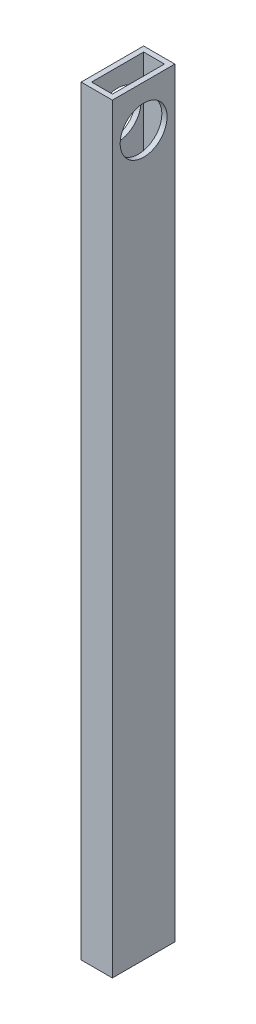
ISO-10303-21;
HEADER;
FILE_DESCRIPTION(('STEP AP214'),'2;1');
FILE_NAME('part.step','',(''),(''),'','','');
FILE_SCHEMA(('AUTOMOTIVE_DESIGN { 1 0 10303 214 1 1 1 1 }'));
ENDSEC;
DATA;
#1=APPLICATION_CONTEXT('core data for automotive mechanical design processes');
#2=APPLICATION_PROTOCOL_DEFINITION('international standard','automotive_design',2000,#1);
#3=PRODUCT_CONTEXT('',#1,'mechanical');
#4=PRODUCT('Part','Part','',(#3));
#5=PRODUCT_RELATED_PRODUCT_CATEGORY('part','',(#4));
#6=PRODUCT_DEFINITION_FORMATION('','',#4);
#7=PRODUCT_DEFINITION_CONTEXT('part definition',#1,'design');
#8=PRODUCT_DEFINITION('design','',#6,#7);
#9=PRODUCT_DEFINITION_SHAPE('','',#8);
#10=(LENGTH_UNIT() NAMED_UNIT(*) SI_UNIT(.MILLI.,.METRE.));
#11=(NAMED_UNIT(*) PLANE_ANGLE_UNIT() SI_UNIT($,.RADIAN.));
#12=(NAMED_UNIT(*) SI_UNIT($,.STERADIAN.) SOLID_ANGLE_UNIT());
#13=UNCERTAINTY_MEASURE_WITH_UNIT(LENGTH_MEASURE(1.E-05),#10,'distance_accuracy_value','');
#14=(GEOMETRIC_REPRESENTATION_CONTEXT(3) GLOBAL_UNCERTAINTY_ASSIGNED_CONTEXT((#13)) GLOBAL_UNIT_ASSIGNED_CONTEXT((#10,
#11,#12)) REPRESENTATION_CONTEXT('',''));
#15=CARTESIAN_POINT('',(0.,0.,0.));
#16=DIRECTION('',(0.,0.,1.));
#17=DIRECTION('',(1.,0.,0.));
#18=AXIS2_PLACEMENT_3D('',#15,#16,#17);
#19=CARTESIAN_POINT('',(0.,463.55,0.));
#20=DIRECTION('',(0.,1.,0.));
#21=DIRECTION('',(0.,0.,1.));
#22=AXIS2_PLACEMENT_3D('',#19,#20,#21);
#23=PLANE('',#22);
#24=DIRECTION('',(0.,0.,1.));
#25=VECTOR('',#24,1.);
#26=CARTESIAN_POINT('',(0.,463.55,0.));
#27=LINE('',#26,#25);
#28=CARTESIAN_POINT('',(0.,463.55,-38.1));
#29=VERTEX_POINT('',#28);
#30=CARTESIAN_POINT('',(0.,463.55,0.));
#31=VERTEX_POINT('',#30);
#32=EDGE_CURVE('E161',#29,#31,#27,.T.);
#33=ORIENTED_EDGE('',*,*,#32,.T.);
#34=DIRECTION('',(1.,0.,0.));
#35=VECTOR('',#34,1.);
#36=CARTESIAN_POINT('',(0.,463.55,0.));
#37=LINE('',#36,#35);
#38=CARTESIAN_POINT('',(19.05,463.55,0.));
#39=VERTEX_POINT('',#38);
#40=EDGE_CURVE('E164',#31,#39,#37,.T.);
#41=ORIENTED_EDGE('',*,*,#40,.T.);
#42=DIRECTION('',(0.,0.,-1.));
#43=VECTOR('',#42,1.);
#44=CARTESIAN_POINT('',(19.05,463.55,0.));
#45=LINE('',#44,#43);
#46=CARTESIAN_POINT('',(19.05,463.55,-38.1));
#47=VERTEX_POINT('',#46);
#48=EDGE_CURVE('E167',#39,#47,#45,.T.);
#49=ORIENTED_EDGE('',*,*,#48,.T.);
#50=DIRECTION('',(-1.,0.,0.));
#51=VECTOR('',#50,1.);
#52=CARTESIAN_POINT('',(0.,463.55,-38.1));
#53=LINE('',#52,#51);
#54=EDGE_CURVE('E169',#47,#29,#53,.T.);
#55=ORIENTED_EDGE('',*,*,#54,.T.);
#56=EDGE_LOOP('',(#33,#41,#49,#55));
#57=FACE_BOUND('',#56,.T.);
#58=DIRECTION('',(1.,0.,0.));
#59=VECTOR('',#58,1.);
#60=CARTESIAN_POINT('',(0.,463.55,-3.175));
#61=LINE('',#60,#59);
#62=CARTESIAN_POINT('',(3.175,463.55,-3.175));
#63=VERTEX_POINT('',#62);
#64=CARTESIAN_POINT('',(15.875,463.55,-3.175));
#65=VERTEX_POINT('',#64);
#66=EDGE_CURVE('E131',#63,#65,#61,.T.);
#67=ORIENTED_EDGE('',*,*,#66,.F.);
#68=DIRECTION('',(0.,0.,1.));
#69=VECTOR('',#68,1.);
#70=CARTESIAN_POINT('',(3.175,463.55,0.));
#71=LINE('',#70,#69);
#72=CARTESIAN_POINT('',(3.175,463.55,-34.925));
#73=VERTEX_POINT('',#72);
#74=EDGE_CURVE('E123',#73,#63,#71,.T.);
#75=ORIENTED_EDGE('',*,*,#74,.F.);
#76=DIRECTION('',(-1.,0.,0.));
#77=VECTOR('',#76,1.);
#78=CARTESIAN_POINT('',(0.,463.55,-34.925));
#79=LINE('',#78,#77);
#80=CARTESIAN_POINT('',(15.875,463.55,-34.925));
#81=VERTEX_POINT('',#80);
#82=EDGE_CURVE('E145',#81,#73,#79,.T.);
#83=ORIENTED_EDGE('',*,*,#82,.F.);
#84=DIRECTION('',(0.,0.,-1.));
#85=VECTOR('',#84,1.);
#86=CARTESIAN_POINT('',(15.875,463.55,0.));
#87=LINE('',#86,#85);
#88=EDGE_CURVE('E143',#65,#81,#87,.T.);
#89=ORIENTED_EDGE('',*,*,#88,.F.);
#90=EDGE_LOOP('',(#67,#75,#83,#89));
#91=FACE_BOUND('',#90,.T.);
#92=ADVANCED_FACE('F57',(#57,#91),#23,.T.);
#93=CARTESIAN_POINT('',(0.,0.,0.));
#94=DIRECTION('',(0.,1.,0.));
#95=DIRECTION('',(0.,0.,1.));
#96=AXIS2_PLACEMENT_3D('',#93,#94,#95);
#97=PLANE('',#96);
#98=DIRECTION('',(0.,0.,1.));
#99=VECTOR('',#98,1.);
#100=CARTESIAN_POINT('',(0.,0.,0.));
#101=LINE('',#100,#99);
#102=CARTESIAN_POINT('',(0.,0.,-38.1));
#103=VERTEX_POINT('',#102);
#104=CARTESIAN_POINT('',(0.,0.,0.));
#105=VERTEX_POINT('',#104);
#106=EDGE_CURVE('E139',#103,#105,#101,.T.);
#107=ORIENTED_EDGE('',*,*,#106,.F.);
#108=DIRECTION('',(-1.,0.,0.));
#109=VECTOR('',#108,1.);
#110=CARTESIAN_POINT('',(0.,0.,-38.1));
#111=LINE('',#110,#109);
#112=CARTESIAN_POINT('',(19.05,0.,-38.1));
#113=VERTEX_POINT('',#112);
#114=EDGE_CURVE('E165',#113,#103,#111,.T.);
#115=ORIENTED_EDGE('',*,*,#114,.F.);
#116=DIRECTION('',(0.,0.,-1.));
#117=VECTOR('',#116,1.);
#118=CARTESIAN_POINT('',(19.05,0.,0.));
#119=LINE('',#118,#117);
#120=CARTESIAN_POINT('',(19.05,0.,0.));
#121=VERTEX_POINT('',#120);
#122=EDGE_CURVE('E176',#121,#113,#119,.T.);
#123=ORIENTED_EDGE('',*,*,#122,.F.);
#124=DIRECTION('',(1.,0.,0.));
#125=VECTOR('',#124,1.);
#126=CARTESIAN_POINT('',(0.,0.,0.));
#127=LINE('',#126,#125);
#128=EDGE_CURVE('E174',#105,#121,#127,.T.);
#129=ORIENTED_EDGE('',*,*,#128,.F.);
#130=EDGE_LOOP('',(#107,#115,#123,#129));
#131=FACE_BOUND('',#130,.T.);
#132=DIRECTION('',(0.,0.,1.));
#133=VECTOR('',#132,1.);
#134=CARTESIAN_POINT('',(3.175,0.,0.));
#135=LINE('',#134,#133);
#136=CARTESIAN_POINT('',(3.175,0.,-34.925));
#137=VERTEX_POINT('',#136);
#138=CARTESIAN_POINT('',(3.175,0.,-3.175));
#139=VERTEX_POINT('',#138);
#140=EDGE_CURVE('E81',#137,#139,#135,.T.);
#141=ORIENTED_EDGE('',*,*,#140,.T.);
#142=DIRECTION('',(1.,0.,0.));
#143=VECTOR('',#142,1.);
#144=CARTESIAN_POINT('',(0.,0.,-3.175));
#145=LINE('',#144,#143);
#146=CARTESIAN_POINT('',(15.875,0.,-3.175));
#147=VERTEX_POINT('',#146);
#148=EDGE_CURVE('E138',#139,#147,#145,.T.);
#149=ORIENTED_EDGE('',*,*,#148,.T.);
#150=DIRECTION('',(0.,0.,-1.));
#151=VECTOR('',#150,1.);
#152=CARTESIAN_POINT('',(15.875,0.,0.));
#153=LINE('',#152,#151);
#154=CARTESIAN_POINT('',(15.875,0.,-34.925));
#155=VERTEX_POINT('',#154);
#156=EDGE_CURVE('E153',#147,#155,#153,.T.);
#157=ORIENTED_EDGE('',*,*,#156,.T.);
#158=DIRECTION('',(-1.,0.,0.));
#159=VECTOR('',#158,1.);
#160=CARTESIAN_POINT('',(0.,0.,-34.925));
#161=LINE('',#160,#159);
#162=EDGE_CURVE('E132',#155,#137,#161,.T.);
#163=ORIENTED_EDGE('',*,*,#162,.T.);
#164=EDGE_LOOP('',(#141,#149,#157,#163));
#165=FACE_BOUND('',#164,.T.);
#166=ADVANCED_FACE('F195',(#131,#165),#97,.F.);
#167=CARTESIAN_POINT('',(0.,463.55,0.));
#168=DIRECTION('',(1.,0.,0.));
#169=DIRECTION('',(0.,0.,-1.));
#170=AXIS2_PLACEMENT_3D('',#167,#168,#169);
#171=PLANE('',#170);
#172=CARTESIAN_POINT('',(0.,438.15,-19.05));
#173=DIRECTION('',(1.,0.,0.));
#174=DIRECTION('',(0.,0.,-1.));
#175=AXIS2_PLACEMENT_3D('',#172,#173,#174);
#176=CIRCLE('',#175,14.2875);
#177=CARTESIAN_POINT('',(0.,438.15,-33.3375));
#178=VERTEX_POINT('',#177);
#179=EDGE_CURVE('E236',#178,#178,#176,.T.);
#180=ORIENTED_EDGE('',*,*,#179,.T.);
#181=EDGE_LOOP('',(#180));
#182=FACE_BOUND('',#181,.T.);
#183=ORIENTED_EDGE('',*,*,#106,.T.);
#184=DIRECTION('',(0.,-1.,0.));
#185=VECTOR('',#184,1.);
#186=CARTESIAN_POINT('',(0.,463.55,0.));
#187=LINE('',#186,#185);
#188=EDGE_CURVE('E12',#31,#105,#187,.T.);
#189=ORIENTED_EDGE('',*,*,#188,.F.);
#190=ORIENTED_EDGE('',*,*,#32,.F.);
#191=DIRECTION('',(0.,-1.,0.));
#192=VECTOR('',#191,1.);
#193=CARTESIAN_POINT('',(0.,463.55,-38.1));
#194=LINE('',#193,#192);
#195=EDGE_CURVE('E171',#29,#103,#194,.T.);
#196=ORIENTED_EDGE('',*,*,#195,.T.);
#197=EDGE_LOOP('',(#183,#189,#190,#196));
#198=FACE_BOUND('',#197,.T.);
#199=ADVANCED_FACE('F59',(#182,#198),#171,.F.);
#200=CARTESIAN_POINT('',(0.,463.55,0.));
#201=DIRECTION('',(0.,0.,-1.));
#202=DIRECTION('',(-1.,0.,0.));
#203=AXIS2_PLACEMENT_3D('',#200,#201,#202);
#204=PLANE('',#203);
#205=ORIENTED_EDGE('',*,*,#128,.T.);
#206=DIRECTION('',(0.,-1.,0.));
#207=VECTOR('',#206,1.);
#208=CARTESIAN_POINT('',(19.05,463.55,0.));
#209=LINE('',#208,#207);
#210=EDGE_CURVE('E66',#39,#121,#209,.T.);
#211=ORIENTED_EDGE('',*,*,#210,.F.);
#212=ORIENTED_EDGE('',*,*,#40,.F.);
#213=ORIENTED_EDGE('',*,*,#188,.T.);
#214=EDGE_LOOP('',(#205,#211,#212,#213));
#215=FACE_BOUND('',#214,.T.);
#216=ADVANCED_FACE('F205',(#215),#204,.F.);
#217=CARTESIAN_POINT('',(19.05,463.55,0.));
#218=DIRECTION('',(-1.,0.,0.));
#219=DIRECTION('',(0.,0.,1.));
#220=AXIS2_PLACEMENT_3D('',#217,#218,#219);
#221=PLANE('',#220);
#222=CARTESIAN_POINT('',(19.05,438.15,-19.05));
#223=DIRECTION('',(1.,0.,0.));
#224=DIRECTION('',(0.,0.,-1.));
#225=AXIS2_PLACEMENT_3D('',#222,#223,#224);
#226=CIRCLE('',#225,14.2875);
#227=CARTESIAN_POINT('',(19.05,438.15,-33.3375));
#228=VERTEX_POINT('',#227);
#229=EDGE_CURVE('E238',#228,#228,#226,.T.);
#230=ORIENTED_EDGE('',*,*,#229,.F.);
#231=EDGE_LOOP('',(#230));
#232=FACE_BOUND('',#231,.T.);
#233=ORIENTED_EDGE('',*,*,#122,.T.);
#234=DIRECTION('',(0.,-1.,0.));
#235=VECTOR('',#234,1.);
#236=CARTESIAN_POINT('',(19.05,463.55,-38.1));
#237=LINE('',#236,#235);
#238=EDGE_CURVE('E181',#47,#113,#237,.T.);
#239=ORIENTED_EDGE('',*,*,#238,.F.);
#240=ORIENTED_EDGE('',*,*,#48,.F.);
#241=ORIENTED_EDGE('',*,*,#210,.T.);
#242=EDGE_LOOP('',(#233,#239,#240,#241));
#243=FACE_BOUND('',#242,.T.);
#244=ADVANCED_FACE('F189',(#232,#243),#221,.F.);
#245=CARTESIAN_POINT('',(0.,463.55,-38.1));
#246=DIRECTION('',(0.,0.,1.));
#247=DIRECTION('',(1.,0.,0.));
#248=AXIS2_PLACEMENT_3D('',#245,#246,#247);
#249=PLANE('',#248);
#250=ORIENTED_EDGE('',*,*,#114,.T.);
#251=ORIENTED_EDGE('',*,*,#195,.F.);
#252=ORIENTED_EDGE('',*,*,#54,.F.);
#253=ORIENTED_EDGE('',*,*,#238,.T.);
#254=EDGE_LOOP('',(#250,#251,#252,#253));
#255=FACE_BOUND('',#254,.T.);
#256=ADVANCED_FACE('F199',(#255),#249,.F.);
#257=CARTESIAN_POINT('',(3.175,463.55,0.));
#258=DIRECTION('',(1.,0.,0.));
#259=DIRECTION('',(0.,0.,-1.));
#260=AXIS2_PLACEMENT_3D('',#257,#258,#259);
#261=PLANE('',#260);
#262=CARTESIAN_POINT('',(3.175,438.15,-19.05));
#263=DIRECTION('',(1.,0.,0.));
#264=DIRECTION('',(0.,0.,-1.));
#265=AXIS2_PLACEMENT_3D('',#262,#263,#264);
#266=CIRCLE('',#265,14.2875);
#267=CARTESIAN_POINT('',(3.175,438.15,-33.3375));
#268=VERTEX_POINT('',#267);
#269=EDGE_CURVE('E151',#268,#268,#266,.T.);
#270=ORIENTED_EDGE('',*,*,#269,.F.);
#271=EDGE_LOOP('',(#270));
#272=FACE_BOUND('',#271,.T.);
#273=ORIENTED_EDGE('',*,*,#140,.F.);
#274=DIRECTION('',(0.,-1.,0.));
#275=VECTOR('',#274,1.);
#276=CARTESIAN_POINT('',(3.175,463.55,-34.925));
#277=LINE('',#276,#275);
#278=EDGE_CURVE('E127',#73,#137,#277,.T.);
#279=ORIENTED_EDGE('',*,*,#278,.F.);
#280=ORIENTED_EDGE('',*,*,#74,.T.);
#281=DIRECTION('',(0.,-1.,0.));
#282=VECTOR('',#281,1.);
#283=CARTESIAN_POINT('',(3.175,463.55,-3.175));
#284=LINE('',#283,#282);
#285=EDGE_CURVE('E126',#63,#139,#284,.T.);
#286=ORIENTED_EDGE('',*,*,#285,.T.);
#287=EDGE_LOOP('',(#273,#279,#280,#286));
#288=FACE_BOUND('',#287,.T.);
#289=ADVANCED_FACE('F125',(#272,#288),#261,.T.);
#290=CARTESIAN_POINT('',(0.,463.55,-3.175));
#291=DIRECTION('',(0.,0.,-1.));
#292=DIRECTION('',(-1.,0.,0.));
#293=AXIS2_PLACEMENT_3D('',#290,#291,#292);
#294=PLANE('',#293);
#295=ORIENTED_EDGE('',*,*,#148,.F.);
#296=ORIENTED_EDGE('',*,*,#285,.F.);
#297=ORIENTED_EDGE('',*,*,#66,.T.);
#298=DIRECTION('',(0.,-1.,0.));
#299=VECTOR('',#298,1.);
#300=CARTESIAN_POINT('',(15.875,463.55,-3.175));
#301=LINE('',#300,#299);
#302=EDGE_CURVE('E140',#65,#147,#301,.T.);
#303=ORIENTED_EDGE('',*,*,#302,.T.);
#304=EDGE_LOOP('',(#295,#296,#297,#303));
#305=FACE_BOUND('',#304,.T.);
#306=ADVANCED_FACE('F135',(#305),#294,.T.);
#307=CARTESIAN_POINT('',(15.875,463.55,0.));
#308=DIRECTION('',(-1.,0.,0.));
#309=DIRECTION('',(0.,0.,1.));
#310=AXIS2_PLACEMENT_3D('',#307,#308,#309);
#311=PLANE('',#310);
#312=CARTESIAN_POINT('',(15.875,438.15,-19.05));
#313=DIRECTION('',(-1.,0.,0.));
#314=DIRECTION('',(0.,0.,1.));
#315=AXIS2_PLACEMENT_3D('',#312,#313,#314);
#316=CIRCLE('',#315,14.2875);
#317=CARTESIAN_POINT('',(15.875,438.15,-4.76249999999999));
#318=VERTEX_POINT('',#317);
#319=EDGE_CURVE('E61',#318,#318,#316,.T.);
#320=ORIENTED_EDGE('',*,*,#319,.F.);
#321=EDGE_LOOP('',(#320));
#322=FACE_BOUND('',#321,.T.);
#323=ORIENTED_EDGE('',*,*,#156,.F.);
#324=ORIENTED_EDGE('',*,*,#302,.F.);
#325=ORIENTED_EDGE('',*,*,#88,.T.);
#326=DIRECTION('',(0.,-1.,0.));
#327=VECTOR('',#326,1.);
#328=CARTESIAN_POINT('',(15.875,463.55,-34.925));
#329=LINE('',#328,#327);
#330=EDGE_CURVE('E73',#81,#155,#329,.T.);
#331=ORIENTED_EDGE('',*,*,#330,.T.);
#332=EDGE_LOOP('',(#323,#324,#325,#331));
#333=FACE_BOUND('',#332,.T.);
#334=ADVANCED_FACE('F231',(#322,#333),#311,.T.);
#335=CARTESIAN_POINT('',(0.,463.55,-34.925));
#336=DIRECTION('',(0.,0.,1.));
#337=DIRECTION('',(1.,0.,0.));
#338=AXIS2_PLACEMENT_3D('',#335,#336,#337);
#339=PLANE('',#338);
#340=ORIENTED_EDGE('',*,*,#162,.F.);
#341=ORIENTED_EDGE('',*,*,#330,.F.);
#342=ORIENTED_EDGE('',*,*,#82,.T.);
#343=ORIENTED_EDGE('',*,*,#278,.T.);
#344=EDGE_LOOP('',(#340,#341,#342,#343));
#345=FACE_BOUND('',#344,.T.);
#346=ADVANCED_FACE('F251',(#345),#339,.T.);
#347=CARTESIAN_POINT('',(0.,438.15,-19.05));
#348=DIRECTION('',(1.,0.,0.));
#349=DIRECTION('',(0.,0.,-1.));
#350=AXIS2_PLACEMENT_3D('',#347,#348,#349);
#351=CYLINDRICAL_SURFACE('',#350,14.2875);
#352=ORIENTED_EDGE('',*,*,#319,.T.);
#353=EDGE_LOOP('',(#352));
#354=FACE_BOUND('',#353,.T.);
#355=ORIENTED_EDGE('',*,*,#229,.T.);
#356=EDGE_LOOP('',(#355));
#357=FACE_BOUND('',#356,.T.);
#358=ADVANCED_FACE('F246',(#354,#357),#351,.F.);
#359=ORIENTED_EDGE('',*,*,#269,.T.);
#360=EDGE_LOOP('',(#359));
#361=FACE_BOUND('',#360,.T.);
#362=ORIENTED_EDGE('',*,*,#179,.F.);
#363=EDGE_LOOP('',(#362));
#364=FACE_BOUND('',#363,.T.);
#365=ADVANCED_FACE('F244',(#361,#364),#351,.F.);
#366=CLOSED_SHELL('',(#92,#166,#199,#216,#244,#256,#289,#306,#334,#346,#358,#365));
#367=MANIFOLD_SOLID_BREP('B2',#366);
#368=ADVANCED_BREP_SHAPE_REPRESENTATION('',(#18,#367),#14);
#369=SHAPE_DEFINITION_REPRESENTATION(#9,#368);
ENDSEC;
END-ISO-10303-21;
